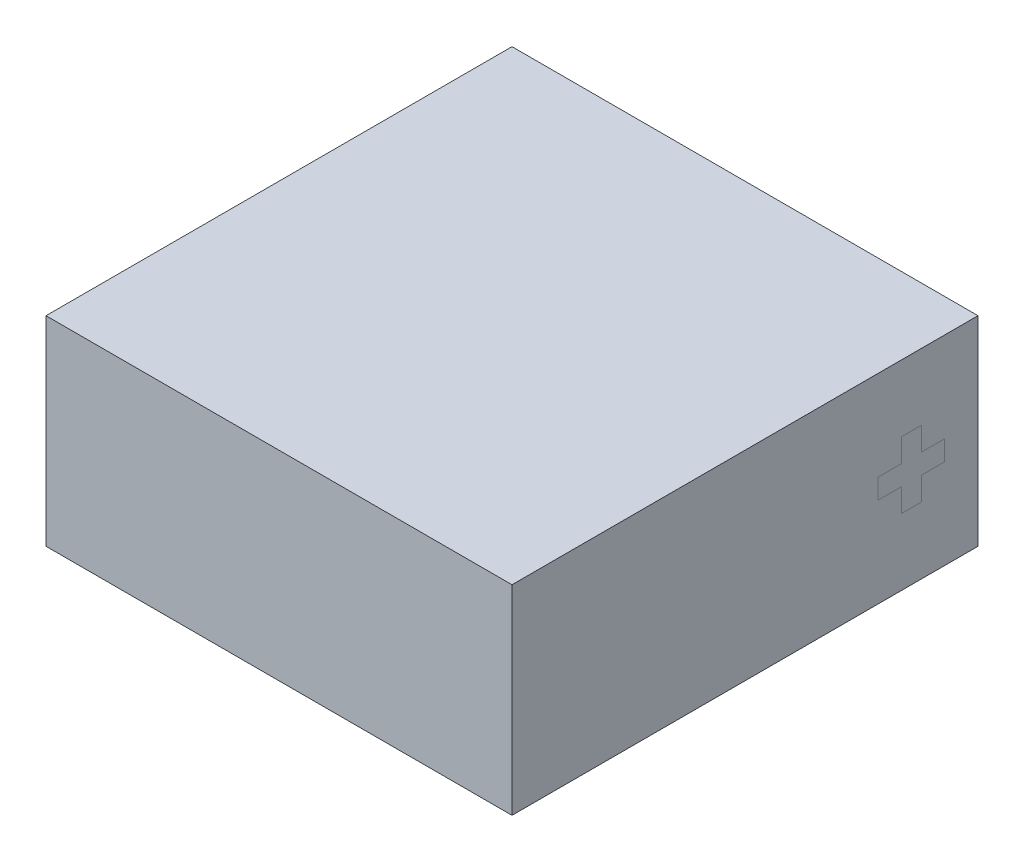
ISO-10303-21;
HEADER;
FILE_DESCRIPTION(('STEP AP214'),'2;1');
FILE_NAME('part.step','',(''),(''),'','','');
FILE_SCHEMA(('AUTOMOTIVE_DESIGN { 1 0 10303 214 1 1 1 1 }'));
ENDSEC;
DATA;
#1=APPLICATION_CONTEXT('core data for automotive mechanical design processes');
#2=APPLICATION_PROTOCOL_DEFINITION('international standard','automotive_design',2000,#1);
#3=PRODUCT_CONTEXT('',#1,'mechanical');
#4=PRODUCT('Part','Part','',(#3));
#5=PRODUCT_RELATED_PRODUCT_CATEGORY('part','',(#4));
#6=PRODUCT_DEFINITION_FORMATION('','',#4);
#7=PRODUCT_DEFINITION_CONTEXT('part definition',#1,'design');
#8=PRODUCT_DEFINITION('design','',#6,#7);
#9=PRODUCT_DEFINITION_SHAPE('','',#8);
#10=(LENGTH_UNIT() NAMED_UNIT(*) SI_UNIT(.MILLI.,.METRE.));
#11=(NAMED_UNIT(*) PLANE_ANGLE_UNIT() SI_UNIT($,.RADIAN.));
#12=(NAMED_UNIT(*) SI_UNIT($,.STERADIAN.) SOLID_ANGLE_UNIT());
#13=UNCERTAINTY_MEASURE_WITH_UNIT(LENGTH_MEASURE(1.E-05),#10,'distance_accuracy_value','');
#14=(GEOMETRIC_REPRESENTATION_CONTEXT(3) GLOBAL_UNCERTAINTY_ASSIGNED_CONTEXT((#13)) GLOBAL_UNIT_ASSIGNED_CONTEXT((#10,
#11,#12)) REPRESENTATION_CONTEXT('',''));
#15=CARTESIAN_POINT('',(0.,0.,0.));
#16=DIRECTION('',(0.,0.,1.));
#17=DIRECTION('',(1.,0.,0.));
#18=AXIS2_PLACEMENT_3D('',#15,#16,#17);
#19=CARTESIAN_POINT('',(3.5,3.,-3.5));
#20=DIRECTION('',(-1.,0.,0.));
#21=DIRECTION('',(0.,0.,1.));
#22=AXIS2_PLACEMENT_3D('',#19,#20,#21);
#23=PLANE('',#22);
#24=DIRECTION('',(0.,1.,0.));
#25=VECTOR('',#24,1.);
#26=CARTESIAN_POINT('',(3.5,1.35,-2.65));
#27=LINE('',#26,#25);
#28=CARTESIAN_POINT('',(3.5,1.,-2.65));
#29=VERTEX_POINT('',#28);
#30=CARTESIAN_POINT('',(3.5,1.35,-2.65));
#31=VERTEX_POINT('',#30);
#32=EDGE_CURVE('E445',#29,#31,#27,.T.);
#33=ORIENTED_EDGE('',*,*,#32,.T.);
#34=DIRECTION('',(0.,0.,-1.));
#35=VECTOR('',#34,1.);
#36=CARTESIAN_POINT('',(3.5,1.35,-2.65));
#37=LINE('',#36,#35);
#38=CARTESIAN_POINT('',(3.5,1.35,-3.));
#39=VERTEX_POINT('',#38);
#40=EDGE_CURVE('E13',#31,#39,#37,.T.);
#41=ORIENTED_EDGE('',*,*,#40,.T.);
#42=DIRECTION('',(0.,1.,0.));
#43=VECTOR('',#42,1.);
#44=CARTESIAN_POINT('',(3.5,1.65,-3.));
#45=LINE('',#44,#43);
#46=CARTESIAN_POINT('',(3.5,1.65,-3.));
#47=VERTEX_POINT('',#46);
#48=EDGE_CURVE('E357',#39,#47,#45,.T.);
#49=ORIENTED_EDGE('',*,*,#48,.T.);
#50=DIRECTION('',(0.,0.,1.));
#51=VECTOR('',#50,1.);
#52=CARTESIAN_POINT('',(3.5,1.65,-2.65));
#53=LINE('',#52,#51);
#54=CARTESIAN_POINT('',(3.5,1.65,-2.65));
#55=VERTEX_POINT('',#54);
#56=EDGE_CURVE('E477',#47,#55,#53,.T.);
#57=ORIENTED_EDGE('',*,*,#56,.T.);
#58=DIRECTION('',(0.,1.,0.));
#59=VECTOR('',#58,1.);
#60=CARTESIAN_POINT('',(3.5,2.,-2.65));
#61=LINE('',#60,#59);
#62=CARTESIAN_POINT('',(3.5,2.,-2.65));
#63=VERTEX_POINT('',#62);
#64=EDGE_CURVE('E474',#55,#63,#61,.T.);
#65=ORIENTED_EDGE('',*,*,#64,.T.);
#66=DIRECTION('',(0.,0.,1.));
#67=VECTOR('',#66,1.);
#68=CARTESIAN_POINT('',(3.5,2.,-2.65));
#69=LINE('',#68,#67);
#70=CARTESIAN_POINT('',(3.5,2.,-2.35));
#71=VERTEX_POINT('',#70);
#72=EDGE_CURVE('E471',#63,#71,#69,.T.);
#73=ORIENTED_EDGE('',*,*,#72,.T.);
#74=DIRECTION('',(0.,-1.,0.));
#75=VECTOR('',#74,1.);
#76=CARTESIAN_POINT('',(3.5,2.,-2.35));
#77=LINE('',#76,#75);
#78=CARTESIAN_POINT('',(3.5,1.65,-2.35));
#79=VERTEX_POINT('',#78);
#80=EDGE_CURVE('E468',#71,#79,#77,.T.);
#81=ORIENTED_EDGE('',*,*,#80,.T.);
#82=DIRECTION('',(0.,0.,1.));
#83=VECTOR('',#82,1.);
#84=CARTESIAN_POINT('',(3.5,1.65,-2.));
#85=LINE('',#84,#83);
#86=CARTESIAN_POINT('',(3.5,1.65,-2.));
#87=VERTEX_POINT('',#86);
#88=EDGE_CURVE('E465',#79,#87,#85,.T.);
#89=ORIENTED_EDGE('',*,*,#88,.T.);
#90=DIRECTION('',(0.,-1.,0.));
#91=VECTOR('',#90,1.);
#92=CARTESIAN_POINT('',(3.5,1.65,-2.));
#93=LINE('',#92,#91);
#94=CARTESIAN_POINT('',(3.5,1.35,-2.));
#95=VERTEX_POINT('',#94);
#96=EDGE_CURVE('E462',#87,#95,#93,.T.);
#97=ORIENTED_EDGE('',*,*,#96,.T.);
#98=DIRECTION('',(0.,0.,-1.));
#99=VECTOR('',#98,1.);
#100=CARTESIAN_POINT('',(3.5,1.35,-2.));
#101=LINE('',#100,#99);
#102=CARTESIAN_POINT('',(3.5,1.35,-2.35));
#103=VERTEX_POINT('',#102);
#104=EDGE_CURVE('E459',#95,#103,#101,.T.);
#105=ORIENTED_EDGE('',*,*,#104,.T.);
#106=DIRECTION('',(0.,-1.,0.));
#107=VECTOR('',#106,1.);
#108=CARTESIAN_POINT('',(3.5,1.35,-2.35));
#109=LINE('',#108,#107);
#110=CARTESIAN_POINT('',(3.5,1.,-2.35));
#111=VERTEX_POINT('',#110);
#112=EDGE_CURVE('E456',#103,#111,#109,.T.);
#113=ORIENTED_EDGE('',*,*,#112,.T.);
#114=DIRECTION('',(0.,0.,-1.));
#115=VECTOR('',#114,1.);
#116=CARTESIAN_POINT('',(3.5,1.,-2.65));
#117=LINE('',#116,#115);
#118=EDGE_CURVE('E448',#111,#29,#117,.T.);
#119=ORIENTED_EDGE('',*,*,#118,.T.);
#120=EDGE_LOOP('',(#33,#41,#49,#57,#65,#73,#81,#89,#97,#105,#113,#119));
#121=FACE_BOUND('',#120,.T.);
#122=ADVANCED_FACE('F348',(#121),#23,.F.);
#123=CARTESIAN_POINT('',(-3.5,3.,-3.5));
#124=DIRECTION('',(1.,0.,0.));
#125=DIRECTION('',(0.,0.,-1.));
#126=AXIS2_PLACEMENT_3D('',#123,#124,#125);
#127=PLANE('',#126);
#128=DIRECTION('',(0.,0.,1.));
#129=VECTOR('',#128,1.);
#130=CARTESIAN_POINT('',(-3.5,0.,-3.5));
#131=LINE('',#130,#129);
#132=CARTESIAN_POINT('',(-3.5,0.,-3.5));
#133=VERTEX_POINT('',#132);
#134=CARTESIAN_POINT('',(-3.5,0.,3.5));
#135=VERTEX_POINT('',#134);
#136=EDGE_CURVE('E444',#133,#135,#131,.T.);
#137=ORIENTED_EDGE('',*,*,#136,.T.);
#138=DIRECTION('',(0.,-1.,0.));
#139=VECTOR('',#138,1.);
#140=CARTESIAN_POINT('',(-3.5,3.,3.5));
#141=LINE('',#140,#139);
#142=CARTESIAN_POINT('',(-3.5,3.,3.5));
#143=VERTEX_POINT('',#142);
#144=EDGE_CURVE('E425',#143,#135,#141,.T.);
#145=ORIENTED_EDGE('',*,*,#144,.F.);
#146=DIRECTION('',(0.,0.,1.));
#147=VECTOR('',#146,1.);
#148=CARTESIAN_POINT('',(-3.5,3.,-3.5));
#149=LINE('',#148,#147);
#150=CARTESIAN_POINT('',(-3.5,3.,-3.5));
#151=VERTEX_POINT('',#150);
#152=EDGE_CURVE('E432',#151,#143,#149,.T.);
#153=ORIENTED_EDGE('',*,*,#152,.F.);
#154=DIRECTION('',(0.,-1.,0.));
#155=VECTOR('',#154,1.);
#156=CARTESIAN_POINT('',(-3.5,3.,-3.5));
#157=LINE('',#156,#155);
#158=EDGE_CURVE('E528',#151,#133,#157,.T.);
#159=ORIENTED_EDGE('',*,*,#158,.T.);
#160=EDGE_LOOP('',(#137,#145,#153,#159));
#161=FACE_BOUND('',#160,.T.);
#162=ADVANCED_FACE('F350',(#161),#127,.F.);
#163=CARTESIAN_POINT('',(-3.5,3.,3.5));
#164=DIRECTION('',(0.,0.,-1.));
#165=DIRECTION('',(-1.,0.,0.));
#166=AXIS2_PLACEMENT_3D('',#163,#164,#165);
#167=PLANE('',#166);
#168=DIRECTION('',(1.,0.,0.));
#169=VECTOR('',#168,1.);
#170=CARTESIAN_POINT('',(-3.5,0.,3.5));
#171=LINE('',#170,#169);
#172=CARTESIAN_POINT('',(3.5,0.,3.5));
#173=VERTEX_POINT('',#172);
#174=EDGE_CURVE('E525',#135,#173,#171,.T.);
#175=ORIENTED_EDGE('',*,*,#174,.T.);
#176=DIRECTION('',(0.,-1.,0.));
#177=VECTOR('',#176,1.);
#178=CARTESIAN_POINT('',(3.5,3.,3.5));
#179=LINE('',#178,#177);
#180=CARTESIAN_POINT('',(3.5,3.,3.5));
#181=VERTEX_POINT('',#180);
#182=EDGE_CURVE('E428',#181,#173,#179,.T.);
#183=ORIENTED_EDGE('',*,*,#182,.F.);
#184=DIRECTION('',(1.,0.,0.));
#185=VECTOR('',#184,1.);
#186=CARTESIAN_POINT('',(-3.5,3.,3.5));
#187=LINE('',#186,#185);
#188=EDGE_CURVE('E421',#143,#181,#187,.T.);
#189=ORIENTED_EDGE('',*,*,#188,.F.);
#190=ORIENTED_EDGE('',*,*,#144,.T.);
#191=EDGE_LOOP('',(#175,#183,#189,#190));
#192=FACE_BOUND('',#191,.T.);
#193=ADVANCED_FACE('F423',(#192),#167,.F.);
#194=ORIENTED_EDGE('',*,*,#40,.F.);
#195=ORIENTED_EDGE('',*,*,#32,.F.);
#196=ORIENTED_EDGE('',*,*,#118,.F.);
#197=ORIENTED_EDGE('',*,*,#112,.F.);
#198=ORIENTED_EDGE('',*,*,#104,.F.);
#199=ORIENTED_EDGE('',*,*,#96,.F.);
#200=ORIENTED_EDGE('',*,*,#88,.F.);
#201=ORIENTED_EDGE('',*,*,#80,.F.);
#202=ORIENTED_EDGE('',*,*,#72,.F.);
#203=ORIENTED_EDGE('',*,*,#64,.F.);
#204=ORIENTED_EDGE('',*,*,#56,.F.);
#205=ORIENTED_EDGE('',*,*,#48,.F.);
#206=EDGE_LOOP('',(#194,#195,#196,#197,#198,#199,#200,#201,#202,#203,#204,#205));
#207=FACE_BOUND('',#206,.T.);
#208=DIRECTION('',(0.,0.,-1.));
#209=VECTOR('',#208,1.);
#210=CARTESIAN_POINT('',(3.5,0.,-3.5));
#211=LINE('',#210,#209);
#212=CARTESIAN_POINT('',(3.5,0.,-3.5));
#213=VERTEX_POINT('',#212);
#214=EDGE_CURVE('E521',#173,#213,#211,.T.);
#215=ORIENTED_EDGE('',*,*,#214,.T.);
#216=DIRECTION('',(0.,-1.,0.));
#217=VECTOR('',#216,1.);
#218=CARTESIAN_POINT('',(3.5,3.,-3.5));
#219=LINE('',#218,#217);
#220=CARTESIAN_POINT('',(3.5,3.,-3.5));
#221=VERTEX_POINT('',#220);
#222=EDGE_CURVE('E450',#221,#213,#219,.T.);
#223=ORIENTED_EDGE('',*,*,#222,.F.);
#224=DIRECTION('',(0.,0.,-1.));
#225=VECTOR('',#224,1.);
#226=CARTESIAN_POINT('',(3.5,3.,-3.5));
#227=LINE('',#226,#225);
#228=EDGE_CURVE('E431',#181,#221,#227,.T.);
#229=ORIENTED_EDGE('',*,*,#228,.F.);
#230=ORIENTED_EDGE('',*,*,#182,.T.);
#231=EDGE_LOOP('',(#215,#223,#229,#230));
#232=FACE_BOUND('',#231,.T.);
#233=ADVANCED_FACE('F507',(#207,#232),#23,.F.);
#234=CARTESIAN_POINT('',(-3.5,3.,-3.5));
#235=DIRECTION('',(0.,0.,1.));
#236=DIRECTION('',(1.,0.,0.));
#237=AXIS2_PLACEMENT_3D('',#234,#235,#236);
#238=PLANE('',#237);
#239=DIRECTION('',(-1.,0.,0.));
#240=VECTOR('',#239,1.);
#241=CARTESIAN_POINT('',(-3.5,0.,-3.5));
#242=LINE('',#241,#240);
#243=EDGE_CURVE('E441',#213,#133,#242,.T.);
#244=ORIENTED_EDGE('',*,*,#243,.T.);
#245=ORIENTED_EDGE('',*,*,#158,.F.);
#246=DIRECTION('',(-1.,0.,0.));
#247=VECTOR('',#246,1.);
#248=CARTESIAN_POINT('',(-3.5,3.,-3.5));
#249=LINE('',#248,#247);
#250=EDGE_CURVE('E437',#221,#151,#249,.T.);
#251=ORIENTED_EDGE('',*,*,#250,.F.);
#252=ORIENTED_EDGE('',*,*,#222,.T.);
#253=EDGE_LOOP('',(#244,#245,#251,#252));
#254=FACE_BOUND('',#253,.T.);
#255=ADVANCED_FACE('F517',(#254),#238,.F.);
#256=CARTESIAN_POINT('',(0.,3.,0.));
#257=DIRECTION('',(0.,1.,0.));
#258=DIRECTION('',(0.,0.,1.));
#259=AXIS2_PLACEMENT_3D('',#256,#257,#258);
#260=PLANE('',#259);
#261=ORIENTED_EDGE('',*,*,#152,.T.);
#262=ORIENTED_EDGE('',*,*,#188,.T.);
#263=ORIENTED_EDGE('',*,*,#228,.T.);
#264=ORIENTED_EDGE('',*,*,#250,.T.);
#265=EDGE_LOOP('',(#261,#262,#263,#264));
#266=FACE_BOUND('',#265,.T.);
#267=ADVANCED_FACE('F435',(#266),#260,.T.);
#268=CARTESIAN_POINT('',(0.,0.,0.));
#269=DIRECTION('',(0.,1.,0.));
#270=DIRECTION('',(0.,0.,1.));
#271=AXIS2_PLACEMENT_3D('',#268,#269,#270);
#272=PLANE('',#271);
#273=ORIENTED_EDGE('',*,*,#136,.F.);
#274=ORIENTED_EDGE('',*,*,#243,.F.);
#275=ORIENTED_EDGE('',*,*,#214,.F.);
#276=ORIENTED_EDGE('',*,*,#174,.F.);
#277=EDGE_LOOP('',(#273,#274,#275,#276));
#278=FACE_BOUND('',#277,.T.);
#279=ADVANCED_FACE('F529',(#278),#272,.F.);
#280=CLOSED_SHELL('',(#122,#162,#193,#233,#255,#267,#279));
#281=MANIFOLD_SOLID_BREP('B2',#280);
#282=ADVANCED_BREP_SHAPE_REPRESENTATION('',(#18,#281),#14);
#283=SHAPE_DEFINITION_REPRESENTATION(#9,#282);
ENDSEC;
END-ISO-10303-21;
